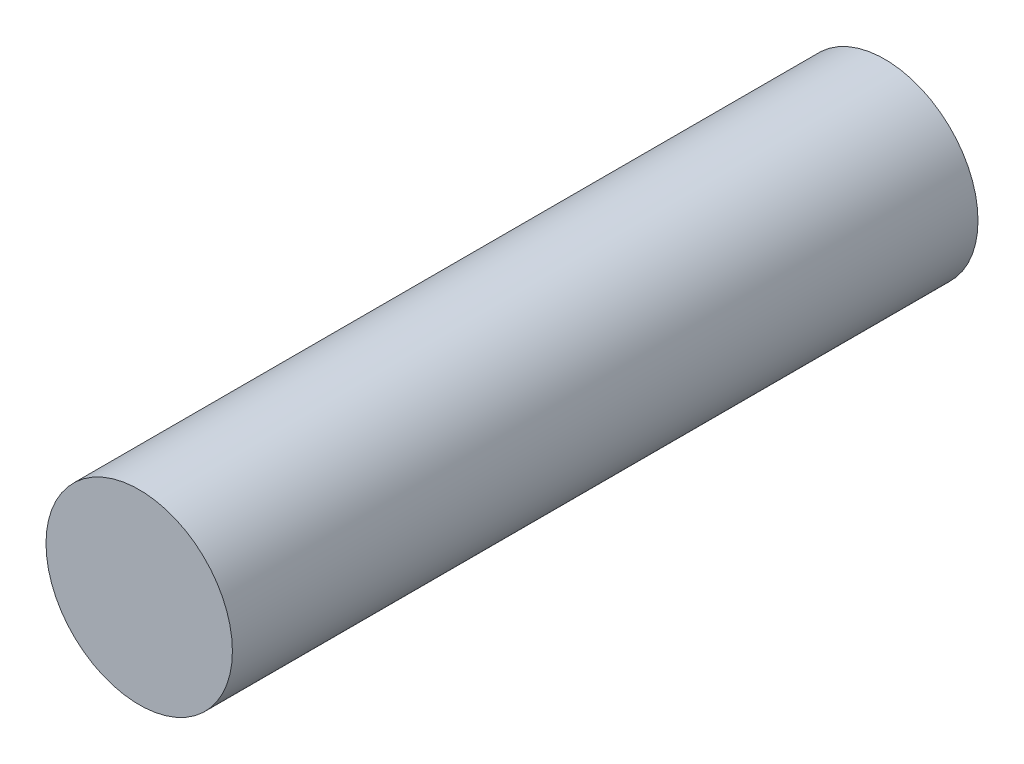
ISO-10303-21;
HEADER;
FILE_DESCRIPTION(('STEP AP214'),'2;1');
FILE_NAME('part.step','',(''),(''),'','','');
FILE_SCHEMA(('AUTOMOTIVE_DESIGN { 1 0 10303 214 1 1 1 1 }'));
ENDSEC;
DATA;
#1=APPLICATION_CONTEXT('core data for automotive mechanical design processes');
#2=APPLICATION_PROTOCOL_DEFINITION('international standard','automotive_design',2000,#1);
#3=PRODUCT_CONTEXT('',#1,'mechanical');
#4=PRODUCT('Part','Part','',(#3));
#5=PRODUCT_RELATED_PRODUCT_CATEGORY('part','',(#4));
#6=PRODUCT_DEFINITION_FORMATION('','',#4);
#7=PRODUCT_DEFINITION_CONTEXT('part definition',#1,'design');
#8=PRODUCT_DEFINITION('design','',#6,#7);
#9=PRODUCT_DEFINITION_SHAPE('','',#8);
#10=(LENGTH_UNIT() NAMED_UNIT(*) SI_UNIT(.MILLI.,.METRE.));
#11=(NAMED_UNIT(*) PLANE_ANGLE_UNIT() SI_UNIT($,.RADIAN.));
#12=(NAMED_UNIT(*) SI_UNIT($,.STERADIAN.) SOLID_ANGLE_UNIT());
#13=UNCERTAINTY_MEASURE_WITH_UNIT(LENGTH_MEASURE(1.E-05),#10,'distance_accuracy_value','');
#14=(GEOMETRIC_REPRESENTATION_CONTEXT(3) GLOBAL_UNCERTAINTY_ASSIGNED_CONTEXT((#13)) GLOBAL_UNIT_ASSIGNED_CONTEXT((#10,
#11,#12)) REPRESENTATION_CONTEXT('',''));
#15=CARTESIAN_POINT('',(0.,0.,0.));
#16=DIRECTION('',(0.,0.,1.));
#17=DIRECTION('',(1.,0.,0.));
#18=AXIS2_PLACEMENT_3D('',#15,#16,#17);
#19=CARTESIAN_POINT('',(0.,0.,12.));
#20=DIRECTION('',(0.,0.,-1.));
#21=DIRECTION('',(-1.,0.,0.));
#22=AXIS2_PLACEMENT_3D('',#19,#20,#21);
#23=CYLINDRICAL_SURFACE('',#22,1.5);
#24=CARTESIAN_POINT('',(0.,0.,12.));
#25=DIRECTION('',(0.,0.,1.));
#26=DIRECTION('',(1.,0.,0.));
#27=AXIS2_PLACEMENT_3D('',#24,#25,#26);
#28=CIRCLE('',#27,1.5);
#29=CARTESIAN_POINT('',(1.5,0.,12.));
#30=VERTEX_POINT('',#29);
#31=EDGE_CURVE('E10',#30,#30,#28,.T.);
#32=ORIENTED_EDGE('',*,*,#31,.F.);
#33=EDGE_LOOP('',(#32));
#34=FACE_BOUND('',#33,.T.);
#35=CARTESIAN_POINT('',(0.,0.,0.));
#36=DIRECTION('',(0.,0.,1.));
#37=DIRECTION('',(1.,0.,0.));
#38=AXIS2_PLACEMENT_3D('',#35,#36,#37);
#39=CIRCLE('',#38,1.5);
#40=CARTESIAN_POINT('',(1.5,0.,0.));
#41=VERTEX_POINT('',#40);
#42=EDGE_CURVE('E38',#41,#41,#39,.T.);
#43=ORIENTED_EDGE('',*,*,#42,.T.);
#44=EDGE_LOOP('',(#43));
#45=FACE_BOUND('',#44,.T.);
#46=ADVANCED_FACE('F35',(#34,#45),#23,.T.);
#47=CARTESIAN_POINT('',(0.,0.,12.));
#48=DIRECTION('',(0.,0.,1.));
#49=DIRECTION('',(1.,0.,0.));
#50=AXIS2_PLACEMENT_3D('',#47,#48,#49);
#51=PLANE('',#50);
#52=ORIENTED_EDGE('',*,*,#31,.T.);
#53=EDGE_LOOP('',(#52));
#54=FACE_BOUND('',#53,.T.);
#55=ADVANCED_FACE('F50',(#54),#51,.T.);
#56=CARTESIAN_POINT('',(0.,0.,0.));
#57=DIRECTION('',(0.,0.,1.));
#58=DIRECTION('',(1.,0.,0.));
#59=AXIS2_PLACEMENT_3D('',#56,#57,#58);
#60=PLANE('',#59);
#61=ORIENTED_EDGE('',*,*,#42,.F.);
#62=EDGE_LOOP('',(#61));
#63=FACE_BOUND('',#62,.T.);
#64=ADVANCED_FACE('F48',(#63),#60,.F.);
#65=CLOSED_SHELL('',(#46,#55,#64));
#66=MANIFOLD_SOLID_BREP('B2',#65);
#67=ADVANCED_BREP_SHAPE_REPRESENTATION('',(#18,#66),#14);
#68=SHAPE_DEFINITION_REPRESENTATION(#9,#67);
ENDSEC;
END-ISO-10303-21;
